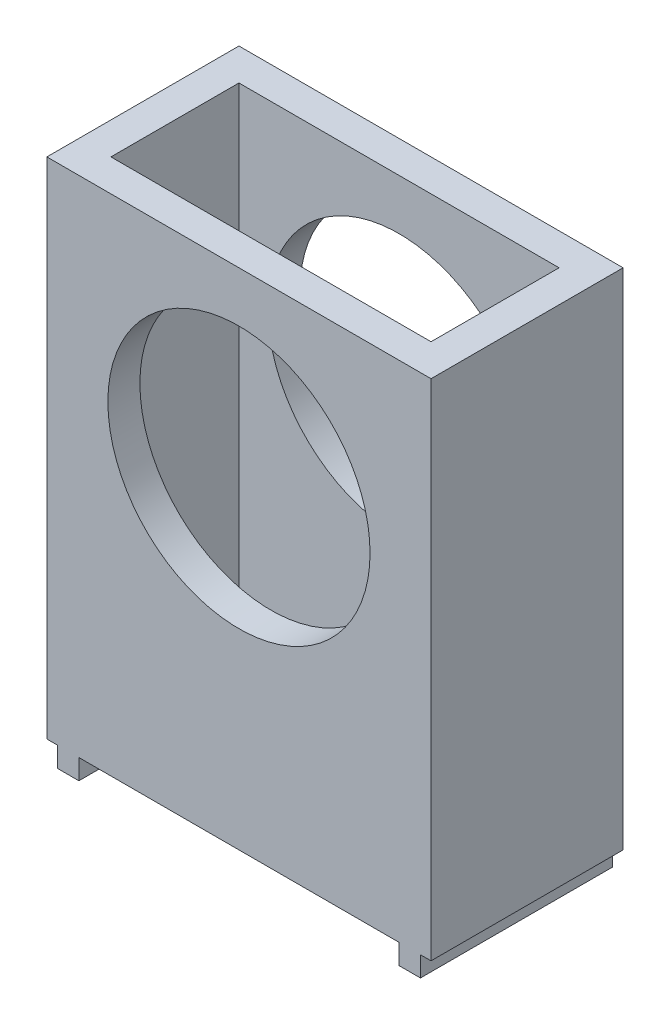
ISO-10303-21;
HEADER;
FILE_DESCRIPTION(('STEP AP214'),'2;1');
FILE_NAME('part.step','',(''),(''),'','','');
FILE_SCHEMA(('AUTOMOTIVE_DESIGN { 1 0 10303 214 1 1 1 1 }'));
ENDSEC;
DATA;
#1=APPLICATION_CONTEXT('core data for automotive mechanical design processes');
#2=APPLICATION_PROTOCOL_DEFINITION('international standard','automotive_design',2000,#1);
#3=PRODUCT_CONTEXT('',#1,'mechanical');
#4=PRODUCT('Part','Part','',(#3));
#5=PRODUCT_RELATED_PRODUCT_CATEGORY('part','',(#4));
#6=PRODUCT_DEFINITION_FORMATION('','',#4);
#7=PRODUCT_DEFINITION_CONTEXT('part definition',#1,'design');
#8=PRODUCT_DEFINITION('design','',#6,#7);
#9=PRODUCT_DEFINITION_SHAPE('','',#8);
#10=(LENGTH_UNIT() NAMED_UNIT(*) SI_UNIT(.MILLI.,.METRE.));
#11=(NAMED_UNIT(*) PLANE_ANGLE_UNIT() SI_UNIT($,.RADIAN.));
#12=(NAMED_UNIT(*) SI_UNIT($,.STERADIAN.) SOLID_ANGLE_UNIT());
#13=UNCERTAINTY_MEASURE_WITH_UNIT(LENGTH_MEASURE(1.E-05),#10,'distance_accuracy_value','');
#14=(GEOMETRIC_REPRESENTATION_CONTEXT(3) GLOBAL_UNCERTAINTY_ASSIGNED_CONTEXT((#13)) GLOBAL_UNIT_ASSIGNED_CONTEXT((#10,
#11,#12)) REPRESENTATION_CONTEXT('',''));
#15=CARTESIAN_POINT('',(0.,0.,0.));
#16=DIRECTION('',(0.,0.,1.));
#17=DIRECTION('',(1.,0.,0.));
#18=AXIS2_PLACEMENT_3D('',#15,#16,#17);
#19=CARTESIAN_POINT('',(0.,-32.,0.));
#20=DIRECTION('',(0.,-1.,0.));
#21=DIRECTION('',(0.,0.,-1.));
#22=AXIS2_PLACEMENT_3D('',#19,#20,#21);
#23=PLANE('',#22);
#24=DIRECTION('',(-1.,0.,0.));
#25=VECTOR('',#24,1.);
#26=CARTESIAN_POINT('',(-19.05,-32.,-9.525));
#27=LINE('',#26,#25);
#28=CARTESIAN_POINT('',(15.875,-32.,-9.525));
#29=VERTEX_POINT('',#28);
#30=CARTESIAN_POINT('',(-15.875,-32.,-9.525));
#31=VERTEX_POINT('',#30);
#32=EDGE_CURVE('E260',#29,#31,#27,.T.);
#33=ORIENTED_EDGE('',*,*,#32,.F.);
#34=DIRECTION('',(0.,0.,-1.));
#35=VECTOR('',#34,1.);
#36=CARTESIAN_POINT('',(15.875,-32.,9.525));
#37=LINE('',#36,#35);
#38=CARTESIAN_POINT('',(15.875,-32.,-6.34999999999999));
#39=VERTEX_POINT('',#38);
#40=EDGE_CURVE('E179',#39,#29,#37,.T.);
#41=ORIENTED_EDGE('',*,*,#40,.F.);
#42=DIRECTION('',(-1.,0.,0.));
#43=VECTOR('',#42,1.);
#44=CARTESIAN_POINT('',(-15.875,-32.,-6.35));
#45=LINE('',#44,#43);
#46=CARTESIAN_POINT('',(-15.875,-32.,-6.35));
#47=VERTEX_POINT('',#46);
#48=EDGE_CURVE('E358',#39,#47,#45,.T.);
#49=ORIENTED_EDGE('',*,*,#48,.T.);
#50=DIRECTION('',(0.,0.,1.));
#51=VECTOR('',#50,1.);
#52=CARTESIAN_POINT('',(-15.875,-32.,9.525));
#53=LINE('',#52,#51);
#54=EDGE_CURVE('E180',#31,#47,#53,.T.);
#55=ORIENTED_EDGE('',*,*,#54,.F.);
#56=EDGE_LOOP('',(#33,#41,#49,#55));
#57=FACE_BOUND('',#56,.T.);
#58=ADVANCED_FACE('F37',(#57),#23,.T.);
#59=DIRECTION('',(1.,0.,0.));
#60=VECTOR('',#59,1.);
#61=CARTESIAN_POINT('',(-15.875,-32.,6.35));
#62=LINE('',#61,#60);
#63=CARTESIAN_POINT('',(-15.875,-32.,6.35));
#64=VERTEX_POINT('',#63);
#65=CARTESIAN_POINT('',(15.875,-32.,6.35));
#66=VERTEX_POINT('',#65);
#67=EDGE_CURVE('E241',#64,#66,#62,.T.);
#68=ORIENTED_EDGE('',*,*,#67,.T.);
#69=CARTESIAN_POINT('',(15.875,-32.,9.525));
#70=VERTEX_POINT('',#69);
#71=EDGE_CURVE('E62',#70,#66,#37,.T.);
#72=ORIENTED_EDGE('',*,*,#71,.F.);
#73=DIRECTION('',(1.,0.,0.));
#74=VECTOR('',#73,1.);
#75=CARTESIAN_POINT('',(-19.05,-32.,9.525));
#76=LINE('',#75,#74);
#77=CARTESIAN_POINT('',(-15.875,-32.,9.525));
#78=VERTEX_POINT('',#77);
#79=EDGE_CURVE('E261',#78,#70,#76,.T.);
#80=ORIENTED_EDGE('',*,*,#79,.F.);
#81=EDGE_CURVE('E11',#64,#78,#53,.T.);
#82=ORIENTED_EDGE('',*,*,#81,.F.);
#83=EDGE_LOOP('',(#68,#72,#80,#82));
#84=FACE_BOUND('',#83,.T.);
#85=ADVANCED_FACE('F297',(#84),#23,.T.);
#86=CARTESIAN_POINT('',(18.,-32.,9.525));
#87=VERTEX_POINT('',#86);
#88=CARTESIAN_POINT('',(19.05,-32.,9.525));
#89=VERTEX_POINT('',#88);
#90=EDGE_CURVE('E41',#87,#89,#76,.T.);
#91=ORIENTED_EDGE('',*,*,#90,.F.);
#92=DIRECTION('',(0.,0.,1.));
#93=VECTOR('',#92,1.);
#94=CARTESIAN_POINT('',(18.,-32.,9.525));
#95=LINE('',#94,#93);
#96=CARTESIAN_POINT('',(18.,-32.,-9.525));
#97=VERTEX_POINT('',#96);
#98=EDGE_CURVE('E173',#97,#87,#95,.T.);
#99=ORIENTED_EDGE('',*,*,#98,.F.);
#100=CARTESIAN_POINT('',(19.05,-32.,-9.525));
#101=VERTEX_POINT('',#100);
#102=EDGE_CURVE('E258',#101,#97,#27,.T.);
#103=ORIENTED_EDGE('',*,*,#102,.F.);
#104=DIRECTION('',(0.,0.,-1.));
#105=VECTOR('',#104,1.);
#106=CARTESIAN_POINT('',(19.05,-32.,9.525));
#107=LINE('',#106,#105);
#108=EDGE_CURVE('E248',#89,#101,#107,.T.);
#109=ORIENTED_EDGE('',*,*,#108,.F.);
#110=EDGE_LOOP('',(#91,#99,#103,#109));
#111=FACE_BOUND('',#110,.T.);
#112=ADVANCED_FACE('F304',(#111),#23,.T.);
#113=CARTESIAN_POINT('',(19.05,-32.,9.525));
#114=DIRECTION('',(1.,0.,0.));
#115=DIRECTION('',(0.,0.,-1.));
#116=AXIS2_PLACEMENT_3D('',#113,#114,#115);
#117=PLANE('',#116);
#118=DIRECTION('',(0.,1.,0.));
#119=VECTOR('',#118,1.);
#120=CARTESIAN_POINT('',(19.05,-32.,-9.525));
#121=LINE('',#120,#119);
#122=CARTESIAN_POINT('',(19.05,18.,-9.525));
#123=VERTEX_POINT('',#122);
#124=EDGE_CURVE('E274',#101,#123,#121,.T.);
#125=ORIENTED_EDGE('',*,*,#124,.T.);
#126=DIRECTION('',(0.,0.,-1.));
#127=VECTOR('',#126,1.);
#128=CARTESIAN_POINT('',(19.05,18.,9.525));
#129=LINE('',#128,#127);
#130=CARTESIAN_POINT('',(19.05,18.,9.525));
#131=VERTEX_POINT('',#130);
#132=EDGE_CURVE('E229',#131,#123,#129,.T.);
#133=ORIENTED_EDGE('',*,*,#132,.F.);
#134=DIRECTION('',(0.,1.,0.));
#135=VECTOR('',#134,1.);
#136=CARTESIAN_POINT('',(19.05,-32.,9.525));
#137=LINE('',#136,#135);
#138=EDGE_CURVE('E47',#89,#131,#137,.T.);
#139=ORIENTED_EDGE('',*,*,#138,.F.);
#140=ORIENTED_EDGE('',*,*,#108,.T.);
#141=EDGE_LOOP('',(#125,#133,#139,#140));
#142=FACE_BOUND('',#141,.T.);
#143=ADVANCED_FACE('F39',(#142),#117,.T.);
#144=CARTESIAN_POINT('',(-19.05,-32.,9.525));
#145=DIRECTION('',(0.,0.,1.));
#146=DIRECTION('',(1.,0.,0.));
#147=AXIS2_PLACEMENT_3D('',#144,#145,#146);
#148=PLANE('',#147);
#149=CARTESIAN_POINT('',(0.,0.,9.525));
#150=DIRECTION('',(0.,0.,1.));
#151=DIRECTION('',(1.,0.,0.));
#152=AXIS2_PLACEMENT_3D('',#149,#150,#151);
#153=CIRCLE('',#152,13.);
#154=CARTESIAN_POINT('',(13.,0.,9.525));
#155=VERTEX_POINT('',#154);
#156=EDGE_CURVE('E210',#155,#155,#153,.T.);
#157=ORIENTED_EDGE('',*,*,#156,.F.);
#158=EDGE_LOOP('',(#157));
#159=FACE_BOUND('',#158,.T.);
#160=ORIENTED_EDGE('',*,*,#138,.T.);
#161=DIRECTION('',(1.,0.,0.));
#162=VECTOR('',#161,1.);
#163=CARTESIAN_POINT('',(-19.05,18.,9.525));
#164=LINE('',#163,#162);
#165=CARTESIAN_POINT('',(-19.05,18.,9.525));
#166=VERTEX_POINT('',#165);
#167=EDGE_CURVE('E238',#166,#131,#164,.T.);
#168=ORIENTED_EDGE('',*,*,#167,.F.);
#169=DIRECTION('',(0.,1.,0.));
#170=VECTOR('',#169,1.);
#171=CARTESIAN_POINT('',(-19.05,-32.,9.525));
#172=LINE('',#171,#170);
#173=CARTESIAN_POINT('',(-19.05,-32.,9.525));
#174=VERTEX_POINT('',#173);
#175=EDGE_CURVE('E270',#174,#166,#172,.T.);
#176=ORIENTED_EDGE('',*,*,#175,.F.);
#177=CARTESIAN_POINT('',(-18.,-32.,9.525));
#178=VERTEX_POINT('',#177);
#179=EDGE_CURVE('E263',#174,#178,#76,.T.);
#180=ORIENTED_EDGE('',*,*,#179,.T.);
#181=DIRECTION('',(0.,1.,0.));
#182=VECTOR('',#181,1.);
#183=CARTESIAN_POINT('',(-18.,-34.,9.525));
#184=LINE('',#183,#182);
#185=CARTESIAN_POINT('',(-18.,-34.,9.525));
#186=VERTEX_POINT('',#185);
#187=EDGE_CURVE('E382',#186,#178,#184,.T.);
#188=ORIENTED_EDGE('',*,*,#187,.F.);
#189=DIRECTION('',(-1.,0.,0.));
#190=VECTOR('',#189,1.);
#191=CARTESIAN_POINT('',(-15.875,-34.,9.525));
#192=LINE('',#191,#190);
#193=CARTESIAN_POINT('',(-15.875,-34.,9.525));
#194=VERTEX_POINT('',#193);
#195=EDGE_CURVE('E192',#194,#186,#192,.T.);
#196=ORIENTED_EDGE('',*,*,#195,.F.);
#197=DIRECTION('',(0.,1.,0.));
#198=VECTOR('',#197,1.);
#199=CARTESIAN_POINT('',(-15.875,-34.,9.525));
#200=LINE('',#199,#198);
#201=EDGE_CURVE('E213',#194,#78,#200,.T.);
#202=ORIENTED_EDGE('',*,*,#201,.T.);
#203=ORIENTED_EDGE('',*,*,#79,.T.);
#204=DIRECTION('',(0.,1.,0.));
#205=VECTOR('',#204,1.);
#206=CARTESIAN_POINT('',(15.875,-34.,9.525));
#207=LINE('',#206,#205);
#208=CARTESIAN_POINT('',(15.875,-34.,9.525));
#209=VERTEX_POINT('',#208);
#210=EDGE_CURVE('E344',#209,#70,#207,.T.);
#211=ORIENTED_EDGE('',*,*,#210,.F.);
#212=DIRECTION('',(-1.,0.,0.));
#213=VECTOR('',#212,1.);
#214=CARTESIAN_POINT('',(15.875,-34.,9.525));
#215=LINE('',#214,#213);
#216=CARTESIAN_POINT('',(18.,-34.,9.525));
#217=VERTEX_POINT('',#216);
#218=EDGE_CURVE('E169',#217,#209,#215,.T.);
#219=ORIENTED_EDGE('',*,*,#218,.F.);
#220=DIRECTION('',(0.,1.,0.));
#221=VECTOR('',#220,1.);
#222=CARTESIAN_POINT('',(18.,-34.,9.525));
#223=LINE('',#222,#221);
#224=EDGE_CURVE('E185',#217,#87,#223,.T.);
#225=ORIENTED_EDGE('',*,*,#224,.T.);
#226=ORIENTED_EDGE('',*,*,#90,.T.);
#227=EDGE_LOOP('',(#160,#168,#176,#180,#188,#196,#202,#203,#211,#219,#225,#226));
#228=FACE_BOUND('',#227,.T.);
#229=ADVANCED_FACE('F322',(#159,#228),#148,.T.);
#230=CARTESIAN_POINT('',(-19.05,-32.,9.525));
#231=DIRECTION('',(-1.,0.,0.));
#232=DIRECTION('',(0.,0.,1.));
#233=AXIS2_PLACEMENT_3D('',#230,#231,#232);
#234=PLANE('',#233);
#235=ORIENTED_EDGE('',*,*,#175,.T.);
#236=DIRECTION('',(0.,0.,1.));
#237=VECTOR('',#236,1.);
#238=CARTESIAN_POINT('',(-19.05,18.,9.525));
#239=LINE('',#238,#237);
#240=CARTESIAN_POINT('',(-19.05,18.,-9.525));
#241=VERTEX_POINT('',#240);
#242=EDGE_CURVE('E235',#241,#166,#239,.T.);
#243=ORIENTED_EDGE('',*,*,#242,.F.);
#244=DIRECTION('',(0.,1.,0.));
#245=VECTOR('',#244,1.);
#246=CARTESIAN_POINT('',(-19.05,-32.,-9.525));
#247=LINE('',#246,#245);
#248=CARTESIAN_POINT('',(-19.05,-32.,-9.525));
#249=VERTEX_POINT('',#248);
#250=EDGE_CURVE('E272',#249,#241,#247,.T.);
#251=ORIENTED_EDGE('',*,*,#250,.F.);
#252=DIRECTION('',(0.,0.,1.));
#253=VECTOR('',#252,1.);
#254=CARTESIAN_POINT('',(-19.05,-32.,9.525));
#255=LINE('',#254,#253);
#256=EDGE_CURVE('E254',#249,#174,#255,.T.);
#257=ORIENTED_EDGE('',*,*,#256,.T.);
#258=EDGE_LOOP('',(#235,#243,#251,#257));
#259=FACE_BOUND('',#258,.T.);
#260=ADVANCED_FACE('F316',(#259),#234,.T.);
#261=CARTESIAN_POINT('',(-19.05,-32.,-9.525));
#262=DIRECTION('',(0.,0.,-1.));
#263=DIRECTION('',(-1.,0.,0.));
#264=AXIS2_PLACEMENT_3D('',#261,#262,#263);
#265=PLANE('',#264);
#266=CARTESIAN_POINT('',(0.,0.,-9.525));
#267=DIRECTION('',(0.,0.,1.));
#268=DIRECTION('',(1.,0.,0.));
#269=AXIS2_PLACEMENT_3D('',#266,#267,#268);
#270=CIRCLE('',#269,13.);
#271=CARTESIAN_POINT('',(13.,0.,-9.525));
#272=VERTEX_POINT('',#271);
#273=EDGE_CURVE('E206',#272,#272,#270,.T.);
#274=ORIENTED_EDGE('',*,*,#273,.T.);
#275=EDGE_LOOP('',(#274));
#276=FACE_BOUND('',#275,.T.);
#277=ORIENTED_EDGE('',*,*,#250,.T.);
#278=DIRECTION('',(-1.,0.,0.));
#279=VECTOR('',#278,1.);
#280=CARTESIAN_POINT('',(-19.05,18.,-9.525));
#281=LINE('',#280,#279);
#282=EDGE_CURVE('E232',#123,#241,#281,.T.);
#283=ORIENTED_EDGE('',*,*,#282,.F.);
#284=ORIENTED_EDGE('',*,*,#124,.F.);
#285=ORIENTED_EDGE('',*,*,#102,.T.);
#286=DIRECTION('',(0.,1.,0.));
#287=VECTOR('',#286,1.);
#288=CARTESIAN_POINT('',(18.,-34.,-9.525));
#289=LINE('',#288,#287);
#290=CARTESIAN_POINT('',(18.,-34.,-9.525));
#291=VERTEX_POINT('',#290);
#292=EDGE_CURVE('E160',#291,#97,#289,.T.);
#293=ORIENTED_EDGE('',*,*,#292,.F.);
#294=DIRECTION('',(1.,0.,0.));
#295=VECTOR('',#294,1.);
#296=CARTESIAN_POINT('',(15.875,-34.,-9.525));
#297=LINE('',#296,#295);
#298=CARTESIAN_POINT('',(15.875,-34.,-9.525));
#299=VERTEX_POINT('',#298);
#300=EDGE_CURVE('E153',#299,#291,#297,.T.);
#301=ORIENTED_EDGE('',*,*,#300,.F.);
#302=DIRECTION('',(0.,1.,0.));
#303=VECTOR('',#302,1.);
#304=CARTESIAN_POINT('',(15.875,-34.,-9.525));
#305=LINE('',#304,#303);
#306=EDGE_CURVE('E157',#299,#29,#305,.T.);
#307=ORIENTED_EDGE('',*,*,#306,.T.);
#308=ORIENTED_EDGE('',*,*,#32,.T.);
#309=DIRECTION('',(0.,1.,0.));
#310=VECTOR('',#309,1.);
#311=CARTESIAN_POINT('',(-15.875,-34.,-9.525));
#312=LINE('',#311,#310);
#313=CARTESIAN_POINT('',(-15.875,-34.,-9.525));
#314=VERTEX_POINT('',#313);
#315=EDGE_CURVE('E198',#314,#31,#312,.T.);
#316=ORIENTED_EDGE('',*,*,#315,.F.);
#317=DIRECTION('',(1.,0.,0.));
#318=VECTOR('',#317,1.);
#319=CARTESIAN_POINT('',(-15.875,-34.,-9.525));
#320=LINE('',#319,#318);
#321=CARTESIAN_POINT('',(-18.,-34.,-9.525));
#322=VERTEX_POINT('',#321);
#323=EDGE_CURVE('E196',#322,#314,#320,.T.);
#324=ORIENTED_EDGE('',*,*,#323,.F.);
#325=DIRECTION('',(0.,1.,0.));
#326=VECTOR('',#325,1.);
#327=CARTESIAN_POINT('',(-18.,-34.,-9.525));
#328=LINE('',#327,#326);
#329=CARTESIAN_POINT('',(-18.,-32.,-9.525));
#330=VERTEX_POINT('',#329);
#331=EDGE_CURVE('E366',#322,#330,#328,.T.);
#332=ORIENTED_EDGE('',*,*,#331,.T.);
#333=EDGE_CURVE('E251',#330,#249,#27,.T.);
#334=ORIENTED_EDGE('',*,*,#333,.T.);
#335=EDGE_LOOP('',(#277,#283,#284,#285,#293,#301,#307,#308,#316,#324,#332,#334));
#336=FACE_BOUND('',#335,.T.);
#337=ADVANCED_FACE('F155',(#276,#336),#265,.T.);
#338=DIRECTION('',(0.,0.,-1.));
#339=VECTOR('',#338,1.);
#340=CARTESIAN_POINT('',(-18.,-32.,9.525));
#341=LINE('',#340,#339);
#342=EDGE_CURVE('E183',#178,#330,#341,.T.);
#343=ORIENTED_EDGE('',*,*,#342,.F.);
#344=ORIENTED_EDGE('',*,*,#179,.F.);
#345=ORIENTED_EDGE('',*,*,#256,.F.);
#346=ORIENTED_EDGE('',*,*,#333,.F.);
#347=EDGE_LOOP('',(#343,#344,#345,#346));
#348=FACE_BOUND('',#347,.T.);
#349=ADVANCED_FACE('F300',(#348),#23,.T.);
#350=CARTESIAN_POINT('',(-15.875,-32.,6.35));
#351=DIRECTION('',(-1.,0.,0.));
#352=DIRECTION('',(0.,0.,1.));
#353=AXIS2_PLACEMENT_3D('',#350,#351,#352);
#354=PLANE('',#353);
#355=DIRECTION('',(0.,1.,0.));
#356=VECTOR('',#355,1.);
#357=CARTESIAN_POINT('',(-15.875,-32.,-6.35));
#358=LINE('',#357,#356);
#359=CARTESIAN_POINT('',(-15.875,18.,-6.35));
#360=VERTEX_POINT('',#359);
#361=EDGE_CURVE('E244',#47,#360,#358,.T.);
#362=ORIENTED_EDGE('',*,*,#361,.T.);
#363=DIRECTION('',(0.,0.,1.));
#364=VECTOR('',#363,1.);
#365=CARTESIAN_POINT('',(-15.875,18.,6.35));
#366=LINE('',#365,#364);
#367=CARTESIAN_POINT('',(-15.875,18.,6.35));
#368=VERTEX_POINT('',#367);
#369=EDGE_CURVE('E217',#360,#368,#366,.T.);
#370=ORIENTED_EDGE('',*,*,#369,.T.);
#371=DIRECTION('',(0.,1.,0.));
#372=VECTOR('',#371,1.);
#373=CARTESIAN_POINT('',(-15.875,-32.,6.35));
#374=LINE('',#373,#372);
#375=EDGE_CURVE('E247',#64,#368,#374,.T.);
#376=ORIENTED_EDGE('',*,*,#375,.F.);
#377=ORIENTED_EDGE('',*,*,#81,.T.);
#378=ORIENTED_EDGE('',*,*,#201,.F.);
#379=DIRECTION('',(0.,0.,1.));
#380=VECTOR('',#379,1.);
#381=CARTESIAN_POINT('',(-15.875,-34.,9.525));
#382=LINE('',#381,#380);
#383=EDGE_CURVE('E189',#314,#194,#382,.T.);
#384=ORIENTED_EDGE('',*,*,#383,.F.);
#385=ORIENTED_EDGE('',*,*,#315,.T.);
#386=ORIENTED_EDGE('',*,*,#54,.T.);
#387=EDGE_LOOP('',(#362,#370,#376,#377,#378,#384,#385,#386));
#388=FACE_BOUND('',#387,.T.);
#389=ADVANCED_FACE('F308',(#388),#354,.F.);
#390=CARTESIAN_POINT('',(-15.875,-32.,-6.35));
#391=DIRECTION('',(0.,0.,-1.));
#392=DIRECTION('',(-1.,0.,0.));
#393=AXIS2_PLACEMENT_3D('',#390,#391,#392);
#394=PLANE('',#393);
#395=CARTESIAN_POINT('',(0.,0.,-6.35));
#396=DIRECTION('',(0.,0.,-1.));
#397=DIRECTION('',(-1.,0.,0.));
#398=AXIS2_PLACEMENT_3D('',#395,#396,#397);
#399=CIRCLE('',#398,13.);
#400=CARTESIAN_POINT('',(-13.,0.,-6.35));
#401=VERTEX_POINT('',#400);
#402=EDGE_CURVE('E214',#401,#401,#399,.T.);
#403=ORIENTED_EDGE('',*,*,#402,.T.);
#404=EDGE_LOOP('',(#403));
#405=FACE_BOUND('',#404,.T.);
#406=DIRECTION('',(0.,1.,0.));
#407=VECTOR('',#406,1.);
#408=CARTESIAN_POINT('',(15.875,-32.,-6.35));
#409=LINE('',#408,#407);
#410=CARTESIAN_POINT('',(15.875,18.,-6.35));
#411=VERTEX_POINT('',#410);
#412=EDGE_CURVE('E242',#39,#411,#409,.T.);
#413=ORIENTED_EDGE('',*,*,#412,.T.);
#414=DIRECTION('',(-1.,0.,0.));
#415=VECTOR('',#414,1.);
#416=CARTESIAN_POINT('',(-15.875,18.,-6.35));
#417=LINE('',#416,#415);
#418=EDGE_CURVE('E226',#411,#360,#417,.T.);
#419=ORIENTED_EDGE('',*,*,#418,.T.);
#420=ORIENTED_EDGE('',*,*,#361,.F.);
#421=ORIENTED_EDGE('',*,*,#48,.F.);
#422=EDGE_LOOP('',(#413,#419,#420,#421));
#423=FACE_BOUND('',#422,.T.);
#424=ADVANCED_FACE('F314',(#405,#423),#394,.F.);
#425=CARTESIAN_POINT('',(15.875,-32.,6.35));
#426=DIRECTION('',(1.,0.,0.));
#427=DIRECTION('',(0.,0.,-1.));
#428=AXIS2_PLACEMENT_3D('',#425,#426,#427);
#429=PLANE('',#428);
#430=DIRECTION('',(0.,1.,0.));
#431=VECTOR('',#430,1.);
#432=CARTESIAN_POINT('',(15.875,-32.,6.35));
#433=LINE('',#432,#431);
#434=CARTESIAN_POINT('',(15.875,18.,6.35));
#435=VERTEX_POINT('',#434);
#436=EDGE_CURVE('E245',#66,#435,#433,.T.);
#437=ORIENTED_EDGE('',*,*,#436,.T.);
#438=DIRECTION('',(0.,0.,-1.));
#439=VECTOR('',#438,1.);
#440=CARTESIAN_POINT('',(15.875,18.,6.35));
#441=LINE('',#440,#439);
#442=EDGE_CURVE('E223',#435,#411,#441,.T.);
#443=ORIENTED_EDGE('',*,*,#442,.T.);
#444=ORIENTED_EDGE('',*,*,#412,.F.);
#445=ORIENTED_EDGE('',*,*,#40,.T.);
#446=ORIENTED_EDGE('',*,*,#306,.F.);
#447=DIRECTION('',(0.,0.,-1.));
#448=VECTOR('',#447,1.);
#449=CARTESIAN_POINT('',(15.875,-34.,9.525));
#450=LINE('',#449,#448);
#451=EDGE_CURVE('E164',#209,#299,#450,.T.);
#452=ORIENTED_EDGE('',*,*,#451,.F.);
#453=ORIENTED_EDGE('',*,*,#210,.T.);
#454=ORIENTED_EDGE('',*,*,#71,.T.);
#455=EDGE_LOOP('',(#437,#443,#444,#445,#446,#452,#453,#454));
#456=FACE_BOUND('',#455,.T.);
#457=ADVANCED_FACE('F176',(#456),#429,.F.);
#458=CARTESIAN_POINT('',(-15.875,-32.,6.35));
#459=DIRECTION('',(0.,0.,1.));
#460=DIRECTION('',(1.,0.,0.));
#461=AXIS2_PLACEMENT_3D('',#458,#459,#460);
#462=PLANE('',#461);
#463=CARTESIAN_POINT('',(0.,0.,6.35));
#464=DIRECTION('',(0.,0.,1.));
#465=DIRECTION('',(1.,0.,0.));
#466=AXIS2_PLACEMENT_3D('',#463,#464,#465);
#467=CIRCLE('',#466,13.);
#468=CARTESIAN_POINT('',(13.,0.,6.35));
#469=VERTEX_POINT('',#468);
#470=EDGE_CURVE('E209',#469,#469,#467,.T.);
#471=ORIENTED_EDGE('',*,*,#470,.T.);
#472=EDGE_LOOP('',(#471));
#473=FACE_BOUND('',#472,.T.);
#474=ORIENTED_EDGE('',*,*,#375,.T.);
#475=DIRECTION('',(1.,0.,0.));
#476=VECTOR('',#475,1.);
#477=CARTESIAN_POINT('',(-15.875,18.,6.35));
#478=LINE('',#477,#476);
#479=EDGE_CURVE('E220',#368,#435,#478,.T.);
#480=ORIENTED_EDGE('',*,*,#479,.T.);
#481=ORIENTED_EDGE('',*,*,#436,.F.);
#482=ORIENTED_EDGE('',*,*,#67,.F.);
#483=EDGE_LOOP('',(#474,#480,#481,#482));
#484=FACE_BOUND('',#483,.T.);
#485=ADVANCED_FACE('F278',(#473,#484),#462,.F.);
#486=CARTESIAN_POINT('',(0.,18.,0.));
#487=DIRECTION('',(0.,-1.,0.));
#488=DIRECTION('',(0.,0.,-1.));
#489=AXIS2_PLACEMENT_3D('',#486,#487,#488);
#490=PLANE('',#489);
#491=ORIENTED_EDGE('',*,*,#132,.T.);
#492=ORIENTED_EDGE('',*,*,#282,.T.);
#493=ORIENTED_EDGE('',*,*,#242,.T.);
#494=ORIENTED_EDGE('',*,*,#167,.T.);
#495=EDGE_LOOP('',(#491,#492,#493,#494));
#496=FACE_BOUND('',#495,.T.);
#497=ORIENTED_EDGE('',*,*,#369,.F.);
#498=ORIENTED_EDGE('',*,*,#418,.F.);
#499=ORIENTED_EDGE('',*,*,#442,.F.);
#500=ORIENTED_EDGE('',*,*,#479,.F.);
#501=EDGE_LOOP('',(#497,#498,#499,#500));
#502=FACE_BOUND('',#501,.T.);
#503=ADVANCED_FACE('F284',(#496,#502),#490,.F.);
#504=CARTESIAN_POINT('',(0.,0.,-9.525));
#505=DIRECTION('',(0.,0.,1.));
#506=DIRECTION('',(1.,0.,0.));
#507=AXIS2_PLACEMENT_3D('',#504,#505,#506);
#508=CYLINDRICAL_SURFACE('',#507,13.);
#509=ORIENTED_EDGE('',*,*,#156,.T.);
#510=EDGE_LOOP('',(#509));
#511=FACE_BOUND('',#510,.T.);
#512=ORIENTED_EDGE('',*,*,#470,.F.);
#513=EDGE_LOOP('',(#512));
#514=FACE_BOUND('',#513,.T.);
#515=ADVANCED_FACE('F281',(#511,#514),#508,.F.);
#516=ORIENTED_EDGE('',*,*,#273,.F.);
#517=EDGE_LOOP('',(#516));
#518=FACE_BOUND('',#517,.T.);
#519=ORIENTED_EDGE('',*,*,#402,.F.);
#520=EDGE_LOOP('',(#519));
#521=FACE_BOUND('',#520,.T.);
#522=ADVANCED_FACE('F283',(#518,#521),#508,.F.);
#523=CARTESIAN_POINT('',(-18.,-34.,9.525));
#524=DIRECTION('',(1.,0.,0.));
#525=DIRECTION('',(0.,0.,-1.));
#526=AXIS2_PLACEMENT_3D('',#523,#524,#525);
#527=PLANE('',#526);
#528=ORIENTED_EDGE('',*,*,#342,.T.);
#529=ORIENTED_EDGE('',*,*,#331,.F.);
#530=DIRECTION('',(0.,0.,-1.));
#531=VECTOR('',#530,1.);
#532=CARTESIAN_POINT('',(-18.,-34.,9.525));
#533=LINE('',#532,#531);
#534=EDGE_CURVE('E194',#186,#322,#533,.T.);
#535=ORIENTED_EDGE('',*,*,#534,.F.);
#536=ORIENTED_EDGE('',*,*,#187,.T.);
#537=EDGE_LOOP('',(#528,#529,#535,#536));
#538=FACE_BOUND('',#537,.T.);
#539=ADVANCED_FACE('F291',(#538),#527,.F.);
#540=CARTESIAN_POINT('',(0.,-34.,0.));
#541=DIRECTION('',(0.,1.,0.));
#542=DIRECTION('',(0.,0.,1.));
#543=AXIS2_PLACEMENT_3D('',#540,#541,#542);
#544=PLANE('',#543);
#545=ORIENTED_EDGE('',*,*,#383,.T.);
#546=ORIENTED_EDGE('',*,*,#195,.T.);
#547=ORIENTED_EDGE('',*,*,#534,.T.);
#548=ORIENTED_EDGE('',*,*,#323,.T.);
#549=EDGE_LOOP('',(#545,#546,#547,#548));
#550=FACE_BOUND('',#549,.T.);
#551=ADVANCED_FACE('F399',(#550),#544,.F.);
#552=CARTESIAN_POINT('',(18.,-34.,9.525));
#553=DIRECTION('',(-1.,0.,0.));
#554=DIRECTION('',(0.,0.,1.));
#555=AXIS2_PLACEMENT_3D('',#552,#553,#554);
#556=PLANE('',#555);
#557=ORIENTED_EDGE('',*,*,#98,.T.);
#558=ORIENTED_EDGE('',*,*,#224,.F.);
#559=DIRECTION('',(0.,0.,1.));
#560=VECTOR('',#559,1.);
#561=CARTESIAN_POINT('',(18.,-34.,9.525));
#562=LINE('',#561,#560);
#563=EDGE_CURVE('E163',#291,#217,#562,.T.);
#564=ORIENTED_EDGE('',*,*,#563,.F.);
#565=ORIENTED_EDGE('',*,*,#292,.T.);
#566=EDGE_LOOP('',(#557,#558,#564,#565));
#567=FACE_BOUND('',#566,.T.);
#568=ADVANCED_FACE('F341',(#567),#556,.F.);
#569=CARTESIAN_POINT('',(0.,-34.,0.));
#570=DIRECTION('',(0.,-1.,0.));
#571=DIRECTION('',(0.,0.,-1.));
#572=AXIS2_PLACEMENT_3D('',#569,#570,#571);
#573=PLANE('',#572);
#574=ORIENTED_EDGE('',*,*,#451,.T.);
#575=ORIENTED_EDGE('',*,*,#300,.T.);
#576=ORIENTED_EDGE('',*,*,#563,.T.);
#577=ORIENTED_EDGE('',*,*,#218,.T.);
#578=EDGE_LOOP('',(#574,#575,#576,#577));
#579=FACE_BOUND('',#578,.T.);
#580=ADVANCED_FACE('F167',(#579),#573,.T.);
#581=CLOSED_SHELL('',(#58,#85,#112,#143,#229,#260,#337,#349,#389,#424,#457,#485,#503,#515,#522,
#539,#551,#568,#580));
#582=MANIFOLD_SOLID_BREP('B2',#581);
#583=ADVANCED_BREP_SHAPE_REPRESENTATION('',(#18,#582),#14);
#584=SHAPE_DEFINITION_REPRESENTATION(#9,#583);
ENDSEC;
END-ISO-10303-21;
